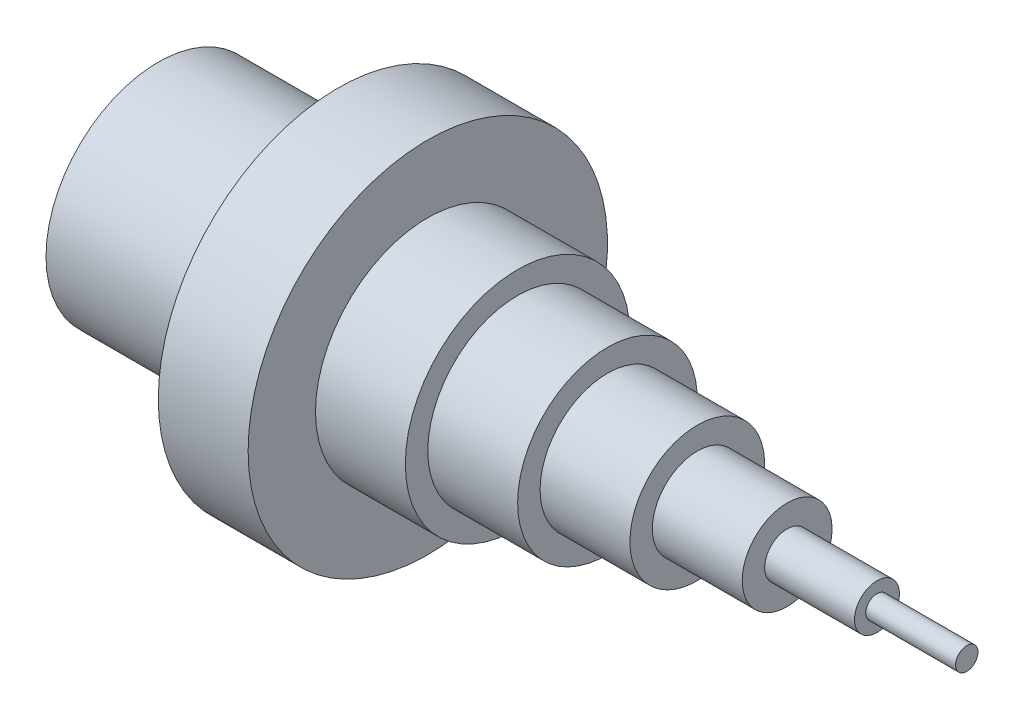
ISO-10303-21;
HEADER;
FILE_DESCRIPTION(('STEP AP214'),'2;1');
FILE_NAME('part.step','',(''),(''),'','','');
FILE_SCHEMA(('AUTOMOTIVE_DESIGN { 1 0 10303 214 1 1 1 1 }'));
ENDSEC;
DATA;
#1=APPLICATION_CONTEXT('core data for automotive mechanical design processes');
#2=APPLICATION_PROTOCOL_DEFINITION('international standard','automotive_design',2000,#1);
#3=PRODUCT_CONTEXT('',#1,'mechanical');
#4=PRODUCT('Part','Part','',(#3));
#5=PRODUCT_RELATED_PRODUCT_CATEGORY('part','',(#4));
#6=PRODUCT_DEFINITION_FORMATION('','',#4);
#7=PRODUCT_DEFINITION_CONTEXT('part definition',#1,'design');
#8=PRODUCT_DEFINITION('design','',#6,#7);
#9=PRODUCT_DEFINITION_SHAPE('','',#8);
#10=(LENGTH_UNIT() NAMED_UNIT(*) SI_UNIT(.MILLI.,.METRE.));
#11=(NAMED_UNIT(*) PLANE_ANGLE_UNIT() SI_UNIT($,.RADIAN.));
#12=(NAMED_UNIT(*) SI_UNIT($,.STERADIAN.) SOLID_ANGLE_UNIT());
#13=UNCERTAINTY_MEASURE_WITH_UNIT(LENGTH_MEASURE(1.E-05),#10,'distance_accuracy_value','');
#14=(GEOMETRIC_REPRESENTATION_CONTEXT(3) GLOBAL_UNCERTAINTY_ASSIGNED_CONTEXT((#13)) GLOBAL_UNIT_ASSIGNED_CONTEXT((#10,
#11,#12)) REPRESENTATION_CONTEXT('',''));
#15=CARTESIAN_POINT('',(0.,0.,0.));
#16=DIRECTION('',(0.,0.,1.));
#17=DIRECTION('',(1.,0.,0.));
#18=AXIS2_PLACEMENT_3D('',#15,#16,#17);
#19=CARTESIAN_POINT('',(0.,0.,0.));
#20=DIRECTION('',(-1.,0.,0.));
#21=DIRECTION('',(0.,0.,1.));
#22=AXIS2_PLACEMENT_3D('',#19,#20,#21);
#23=PLANE('',#22);
#24=CARTESIAN_POINT('',(0.,0.,0.));
#25=DIRECTION('',(-1.,0.,0.));
#26=DIRECTION('',(0.,0.,1.));
#27=AXIS2_PLACEMENT_3D('',#24,#25,#26);
#28=CIRCLE('',#27,20.);
#29=CARTESIAN_POINT('',(0.,0.,20.));
#30=VERTEX_POINT('',#29);
#31=EDGE_CURVE('E87',#30,#30,#28,.T.);
#32=ORIENTED_EDGE('',*,*,#31,.F.);
#33=EDGE_LOOP('',(#32));
#34=FACE_BOUND('',#33,.T.);
#35=CARTESIAN_POINT('',(0.,0.,0.));
#36=DIRECTION('',(-1.,0.,0.));
#37=DIRECTION('',(0.,0.,1.));
#38=AXIS2_PLACEMENT_3D('',#35,#36,#37);
#39=CIRCLE('',#38,25.);
#40=CARTESIAN_POINT('',(0.,0.,25.));
#41=VERTEX_POINT('',#40);
#42=EDGE_CURVE('E10',#41,#41,#39,.T.);
#43=ORIENTED_EDGE('',*,*,#42,.T.);
#44=EDGE_LOOP('',(#43));
#45=FACE_BOUND('',#44,.T.);
#46=ADVANCED_FACE('F31',(#34,#45),#23,.T.);
#47=CARTESIAN_POINT('',(0.,0.,0.));
#48=DIRECTION('',(-1.,0.,0.));
#49=DIRECTION('',(0.,0.,1.));
#50=AXIS2_PLACEMENT_3D('',#47,#48,#49);
#51=CYLINDRICAL_SURFACE('',#50,25.);
#52=CARTESIAN_POINT('',(40.,0.,0.));
#53=DIRECTION('',(-1.,0.,0.));
#54=DIRECTION('',(0.,0.,1.));
#55=AXIS2_PLACEMENT_3D('',#52,#53,#54);
#56=CIRCLE('',#55,25.);
#57=CARTESIAN_POINT('',(40.,0.,25.));
#58=VERTEX_POINT('',#57);
#59=EDGE_CURVE('E37',#58,#58,#56,.T.);
#60=ORIENTED_EDGE('',*,*,#59,.T.);
#61=EDGE_LOOP('',(#60));
#62=FACE_BOUND('',#61,.T.);
#63=ORIENTED_EDGE('',*,*,#42,.F.);
#64=EDGE_LOOP('',(#63));
#65=FACE_BOUND('',#64,.T.);
#66=ADVANCED_FACE('F103',(#62,#65),#51,.T.);
#67=CARTESIAN_POINT('',(40.,0.,25.));
#68=DIRECTION('',(-1.,0.,0.));
#69=DIRECTION('',(0.,0.,1.));
#70=AXIS2_PLACEMENT_3D('',#67,#68,#69);
#71=PLANE('',#70);
#72=CARTESIAN_POINT('',(40.,0.,0.));
#73=DIRECTION('',(-1.,0.,0.));
#74=DIRECTION('',(0.,0.,1.));
#75=AXIS2_PLACEMENT_3D('',#72,#73,#74);
#76=CIRCLE('',#75,40.);
#77=CARTESIAN_POINT('',(40.,0.,40.));
#78=VERTEX_POINT('',#77);
#79=EDGE_CURVE('E41',#78,#78,#76,.T.);
#80=ORIENTED_EDGE('',*,*,#79,.T.);
#81=EDGE_LOOP('',(#80));
#82=FACE_BOUND('',#81,.T.);
#83=ORIENTED_EDGE('',*,*,#59,.F.);
#84=EDGE_LOOP('',(#83));
#85=FACE_BOUND('',#84,.T.);
#86=ADVANCED_FACE('F107',(#82,#85),#71,.T.);
#87=CARTESIAN_POINT('',(0.,0.,0.));
#88=DIRECTION('',(-1.,0.,0.));
#89=DIRECTION('',(0.,0.,1.));
#90=AXIS2_PLACEMENT_3D('',#87,#88,#89);
#91=CYLINDRICAL_SURFACE('',#90,40.);
#92=CARTESIAN_POINT('',(60.,0.,0.));
#93=DIRECTION('',(-1.,0.,0.));
#94=DIRECTION('',(0.,0.,1.));
#95=AXIS2_PLACEMENT_3D('',#92,#93,#94);
#96=CIRCLE('',#95,40.);
#97=CARTESIAN_POINT('',(60.,0.,40.));
#98=VERTEX_POINT('',#97);
#99=EDGE_CURVE('E45',#98,#98,#96,.T.);
#100=ORIENTED_EDGE('',*,*,#99,.T.);
#101=EDGE_LOOP('',(#100));
#102=FACE_BOUND('',#101,.T.);
#103=ORIENTED_EDGE('',*,*,#79,.F.);
#104=EDGE_LOOP('',(#103));
#105=FACE_BOUND('',#104,.T.);
#106=ADVANCED_FACE('F111',(#102,#105),#91,.T.);
#107=CARTESIAN_POINT('',(60.,0.,40.));
#108=DIRECTION('',(1.,0.,0.));
#109=DIRECTION('',(0.,0.,-1.));
#110=AXIS2_PLACEMENT_3D('',#107,#108,#109);
#111=PLANE('',#110);
#112=CARTESIAN_POINT('',(60.,0.,0.));
#113=DIRECTION('',(-1.,0.,0.));
#114=DIRECTION('',(0.,0.,1.));
#115=AXIS2_PLACEMENT_3D('',#112,#113,#114);
#116=CIRCLE('',#115,25.);
#117=CARTESIAN_POINT('',(60.,0.,25.));
#118=VERTEX_POINT('',#117);
#119=EDGE_CURVE('E50',#118,#118,#116,.T.);
#120=ORIENTED_EDGE('',*,*,#119,.T.);
#121=EDGE_LOOP('',(#120));
#122=FACE_BOUND('',#121,.T.);
#123=ORIENTED_EDGE('',*,*,#99,.F.);
#124=EDGE_LOOP('',(#123));
#125=FACE_BOUND('',#124,.T.);
#126=ADVANCED_FACE('F118',(#122,#125),#111,.T.);
#127=CARTESIAN_POINT('',(0.,0.,0.));
#128=DIRECTION('',(-1.,0.,0.));
#129=DIRECTION('',(0.,0.,1.));
#130=AXIS2_PLACEMENT_3D('',#127,#128,#129);
#131=CYLINDRICAL_SURFACE('',#130,25.);
#132=CARTESIAN_POINT('',(80.,0.,0.));
#133=DIRECTION('',(-1.,0.,0.));
#134=DIRECTION('',(0.,0.,1.));
#135=AXIS2_PLACEMENT_3D('',#132,#133,#134);
#136=CIRCLE('',#135,25.);
#137=CARTESIAN_POINT('',(80.,0.,25.));
#138=VERTEX_POINT('',#137);
#139=EDGE_CURVE('E53',#138,#138,#136,.T.);
#140=ORIENTED_EDGE('',*,*,#139,.T.);
#141=EDGE_LOOP('',(#140));
#142=FACE_BOUND('',#141,.T.);
#143=ORIENTED_EDGE('',*,*,#119,.F.);
#144=EDGE_LOOP('',(#143));
#145=FACE_BOUND('',#144,.T.);
#146=ADVANCED_FACE('F122',(#142,#145),#131,.T.);
#147=CARTESIAN_POINT('',(80.,0.,25.));
#148=DIRECTION('',(1.,0.,0.));
#149=DIRECTION('',(0.,0.,-1.));
#150=AXIS2_PLACEMENT_3D('',#147,#148,#149);
#151=PLANE('',#150);
#152=CARTESIAN_POINT('',(80.,0.,0.));
#153=DIRECTION('',(-1.,0.,0.));
#154=DIRECTION('',(0.,0.,1.));
#155=AXIS2_PLACEMENT_3D('',#152,#153,#154);
#156=CIRCLE('',#155,20.);
#157=CARTESIAN_POINT('',(80.,0.,20.));
#158=VERTEX_POINT('',#157);
#159=EDGE_CURVE('E56',#158,#158,#156,.T.);
#160=ORIENTED_EDGE('',*,*,#159,.T.);
#161=EDGE_LOOP('',(#160));
#162=FACE_BOUND('',#161,.T.);
#163=ORIENTED_EDGE('',*,*,#139,.F.);
#164=EDGE_LOOP('',(#163));
#165=FACE_BOUND('',#164,.T.);
#166=ADVANCED_FACE('F126',(#162,#165),#151,.T.);
#167=CARTESIAN_POINT('',(0.,0.,0.));
#168=DIRECTION('',(-1.,0.,0.));
#169=DIRECTION('',(0.,0.,1.));
#170=AXIS2_PLACEMENT_3D('',#167,#168,#169);
#171=CYLINDRICAL_SURFACE('',#170,20.);
#172=CARTESIAN_POINT('',(100.,0.,0.));
#173=DIRECTION('',(-1.,0.,0.));
#174=DIRECTION('',(0.,0.,1.));
#175=AXIS2_PLACEMENT_3D('',#172,#173,#174);
#176=CIRCLE('',#175,20.);
#177=CARTESIAN_POINT('',(100.,0.,20.));
#178=VERTEX_POINT('',#177);
#179=EDGE_CURVE('E59',#178,#178,#176,.T.);
#180=ORIENTED_EDGE('',*,*,#179,.T.);
#181=EDGE_LOOP('',(#180));
#182=FACE_BOUND('',#181,.T.);
#183=ORIENTED_EDGE('',*,*,#159,.F.);
#184=EDGE_LOOP('',(#183));
#185=FACE_BOUND('',#184,.T.);
#186=ADVANCED_FACE('F130',(#182,#185),#171,.T.);
#187=CARTESIAN_POINT('',(100.,0.,20.));
#188=DIRECTION('',(1.,0.,0.));
#189=DIRECTION('',(0.,0.,-1.));
#190=AXIS2_PLACEMENT_3D('',#187,#188,#189);
#191=PLANE('',#190);
#192=CARTESIAN_POINT('',(100.,0.,0.));
#193=DIRECTION('',(-1.,0.,0.));
#194=DIRECTION('',(0.,0.,1.));
#195=AXIS2_PLACEMENT_3D('',#192,#193,#194);
#196=CIRCLE('',#195,15.);
#197=CARTESIAN_POINT('',(100.,0.,15.));
#198=VERTEX_POINT('',#197);
#199=EDGE_CURVE('E62',#198,#198,#196,.T.);
#200=ORIENTED_EDGE('',*,*,#199,.T.);
#201=EDGE_LOOP('',(#200));
#202=FACE_BOUND('',#201,.T.);
#203=ORIENTED_EDGE('',*,*,#179,.F.);
#204=EDGE_LOOP('',(#203));
#205=FACE_BOUND('',#204,.T.);
#206=ADVANCED_FACE('F134',(#202,#205),#191,.T.);
#207=CARTESIAN_POINT('',(0.,0.,0.));
#208=DIRECTION('',(-1.,0.,0.));
#209=DIRECTION('',(0.,0.,1.));
#210=AXIS2_PLACEMENT_3D('',#207,#208,#209);
#211=CYLINDRICAL_SURFACE('',#210,15.);
#212=CARTESIAN_POINT('',(120.,0.,0.));
#213=DIRECTION('',(-1.,0.,0.));
#214=DIRECTION('',(0.,0.,1.));
#215=AXIS2_PLACEMENT_3D('',#212,#213,#214);
#216=CIRCLE('',#215,15.);
#217=CARTESIAN_POINT('',(120.,0.,15.));
#218=VERTEX_POINT('',#217);
#219=EDGE_CURVE('E65',#218,#218,#216,.T.);
#220=ORIENTED_EDGE('',*,*,#219,.T.);
#221=EDGE_LOOP('',(#220));
#222=FACE_BOUND('',#221,.T.);
#223=ORIENTED_EDGE('',*,*,#199,.F.);
#224=EDGE_LOOP('',(#223));
#225=FACE_BOUND('',#224,.T.);
#226=ADVANCED_FACE('F138',(#222,#225),#211,.T.);
#227=CARTESIAN_POINT('',(120.,0.,15.));
#228=DIRECTION('',(1.,0.,0.));
#229=DIRECTION('',(0.,0.,-1.));
#230=AXIS2_PLACEMENT_3D('',#227,#228,#229);
#231=PLANE('',#230);
#232=CARTESIAN_POINT('',(120.,0.,0.));
#233=DIRECTION('',(-1.,0.,0.));
#234=DIRECTION('',(0.,0.,1.));
#235=AXIS2_PLACEMENT_3D('',#232,#233,#234);
#236=CIRCLE('',#235,10.);
#237=CARTESIAN_POINT('',(120.,0.,10.));
#238=VERTEX_POINT('',#237);
#239=EDGE_CURVE('E68',#238,#238,#236,.T.);
#240=ORIENTED_EDGE('',*,*,#239,.T.);
#241=EDGE_LOOP('',(#240));
#242=FACE_BOUND('',#241,.T.);
#243=ORIENTED_EDGE('',*,*,#219,.F.);
#244=EDGE_LOOP('',(#243));
#245=FACE_BOUND('',#244,.T.);
#246=ADVANCED_FACE('F142',(#242,#245),#231,.T.);
#247=CARTESIAN_POINT('',(0.,0.,0.));
#248=DIRECTION('',(-1.,0.,0.));
#249=DIRECTION('',(0.,0.,1.));
#250=AXIS2_PLACEMENT_3D('',#247,#248,#249);
#251=CYLINDRICAL_SURFACE('',#250,10.);
#252=CARTESIAN_POINT('',(140.,0.,0.));
#253=DIRECTION('',(-1.,0.,0.));
#254=DIRECTION('',(0.,0.,1.));
#255=AXIS2_PLACEMENT_3D('',#252,#253,#254);
#256=CIRCLE('',#255,10.);
#257=CARTESIAN_POINT('',(140.,0.,10.));
#258=VERTEX_POINT('',#257);
#259=EDGE_CURVE('E71',#258,#258,#256,.T.);
#260=ORIENTED_EDGE('',*,*,#259,.T.);
#261=EDGE_LOOP('',(#260));
#262=FACE_BOUND('',#261,.T.);
#263=ORIENTED_EDGE('',*,*,#239,.F.);
#264=EDGE_LOOP('',(#263));
#265=FACE_BOUND('',#264,.T.);
#266=ADVANCED_FACE('F146',(#262,#265),#251,.T.);
#267=CARTESIAN_POINT('',(140.,0.,10.));
#268=DIRECTION('',(1.,0.,0.));
#269=DIRECTION('',(0.,0.,-1.));
#270=AXIS2_PLACEMENT_3D('',#267,#268,#269);
#271=PLANE('',#270);
#272=CARTESIAN_POINT('',(140.,0.,0.));
#273=DIRECTION('',(-1.,0.,0.));
#274=DIRECTION('',(0.,0.,1.));
#275=AXIS2_PLACEMENT_3D('',#272,#273,#274);
#276=CIRCLE('',#275,5.);
#277=CARTESIAN_POINT('',(140.,0.,5.));
#278=VERTEX_POINT('',#277);
#279=EDGE_CURVE('E74',#278,#278,#276,.T.);
#280=ORIENTED_EDGE('',*,*,#279,.T.);
#281=EDGE_LOOP('',(#280));
#282=FACE_BOUND('',#281,.T.);
#283=ORIENTED_EDGE('',*,*,#259,.F.);
#284=EDGE_LOOP('',(#283));
#285=FACE_BOUND('',#284,.T.);
#286=ADVANCED_FACE('F150',(#282,#285),#271,.T.);
#287=CARTESIAN_POINT('',(0.,0.,0.));
#288=DIRECTION('',(-1.,0.,0.));
#289=DIRECTION('',(0.,0.,1.));
#290=AXIS2_PLACEMENT_3D('',#287,#288,#289);
#291=CYLINDRICAL_SURFACE('',#290,5.);
#292=CARTESIAN_POINT('',(160.,0.,0.));
#293=DIRECTION('',(-1.,0.,0.));
#294=DIRECTION('',(0.,0.,1.));
#295=AXIS2_PLACEMENT_3D('',#292,#293,#294);
#296=CIRCLE('',#295,5.);
#297=CARTESIAN_POINT('',(160.,0.,5.));
#298=VERTEX_POINT('',#297);
#299=EDGE_CURVE('E77',#298,#298,#296,.T.);
#300=ORIENTED_EDGE('',*,*,#299,.T.);
#301=EDGE_LOOP('',(#300));
#302=FACE_BOUND('',#301,.T.);
#303=ORIENTED_EDGE('',*,*,#279,.F.);
#304=EDGE_LOOP('',(#303));
#305=FACE_BOUND('',#304,.T.);
#306=ADVANCED_FACE('F154',(#302,#305),#291,.T.);
#307=CARTESIAN_POINT('',(160.,0.,5.));
#308=DIRECTION('',(1.,0.,0.));
#309=DIRECTION('',(0.,0.,-1.));
#310=AXIS2_PLACEMENT_3D('',#307,#308,#309);
#311=PLANE('',#310);
#312=CARTESIAN_POINT('',(160.,0.,0.));
#313=DIRECTION('',(-1.,0.,0.));
#314=DIRECTION('',(0.,0.,1.));
#315=AXIS2_PLACEMENT_3D('',#312,#313,#314);
#316=CIRCLE('',#315,2.5);
#317=CARTESIAN_POINT('',(160.,0.,2.5));
#318=VERTEX_POINT('',#317);
#319=EDGE_CURVE('E80',#318,#318,#316,.T.);
#320=ORIENTED_EDGE('',*,*,#319,.T.);
#321=EDGE_LOOP('',(#320));
#322=FACE_BOUND('',#321,.T.);
#323=ORIENTED_EDGE('',*,*,#299,.F.);
#324=EDGE_LOOP('',(#323));
#325=FACE_BOUND('',#324,.T.);
#326=ADVANCED_FACE('F158',(#322,#325),#311,.T.);
#327=CARTESIAN_POINT('',(0.,0.,0.));
#328=DIRECTION('',(-1.,0.,0.));
#329=DIRECTION('',(0.,0.,1.));
#330=AXIS2_PLACEMENT_3D('',#327,#328,#329);
#331=CYLINDRICAL_SURFACE('',#330,2.5);
#332=CARTESIAN_POINT('',(180.,0.,0.));
#333=DIRECTION('',(-1.,0.,0.));
#334=DIRECTION('',(0.,0.,1.));
#335=AXIS2_PLACEMENT_3D('',#332,#333,#334);
#336=CIRCLE('',#335,2.5);
#337=CARTESIAN_POINT('',(180.,0.,2.5));
#338=VERTEX_POINT('',#337);
#339=EDGE_CURVE('E83',#338,#338,#336,.T.);
#340=ORIENTED_EDGE('',*,*,#339,.T.);
#341=EDGE_LOOP('',(#340));
#342=FACE_BOUND('',#341,.T.);
#343=ORIENTED_EDGE('',*,*,#319,.F.);
#344=EDGE_LOOP('',(#343));
#345=FACE_BOUND('',#344,.T.);
#346=ADVANCED_FACE('F162',(#342,#345),#331,.T.);
#347=CARTESIAN_POINT('',(180.,0.,2.5));
#348=DIRECTION('',(1.,0.,0.));
#349=DIRECTION('',(0.,0.,-1.));
#350=AXIS2_PLACEMENT_3D('',#347,#348,#349);
#351=PLANE('',#350);
#352=ORIENTED_EDGE('',*,*,#339,.F.);
#353=EDGE_LOOP('',(#352));
#354=FACE_BOUND('',#353,.T.);
#355=ADVANCED_FACE('F98',(#354),#351,.T.);
#356=CARTESIAN_POINT('',(40.,0.,0.));
#357=DIRECTION('',(-1.,0.,0.));
#358=DIRECTION('',(0.,0.,1.));
#359=AXIS2_PLACEMENT_3D('',#356,#357,#358);
#360=CYLINDRICAL_SURFACE('',#359,20.);
#361=CARTESIAN_POINT('',(40.,0.,0.));
#362=DIRECTION('',(-1.,0.,0.));
#363=DIRECTION('',(0.,0.,1.));
#364=AXIS2_PLACEMENT_3D('',#361,#362,#363);
#365=CIRCLE('',#364,20.);
#366=CARTESIAN_POINT('',(40.,0.,20.));
#367=VERTEX_POINT('',#366);
#368=EDGE_CURVE('E86',#367,#367,#365,.T.);
#369=ORIENTED_EDGE('',*,*,#368,.F.);
#370=EDGE_LOOP('',(#369));
#371=FACE_BOUND('',#370,.T.);
#372=ORIENTED_EDGE('',*,*,#31,.T.);
#373=EDGE_LOOP('',(#372));
#374=FACE_BOUND('',#373,.T.);
#375=ADVANCED_FACE('F95',(#371,#374),#360,.F.);
#376=CARTESIAN_POINT('',(40.,0.,0.));
#377=DIRECTION('',(-1.,0.,0.));
#378=DIRECTION('',(0.,0.,1.));
#379=AXIS2_PLACEMENT_3D('',#376,#377,#378);
#380=PLANE('',#379);
#381=ORIENTED_EDGE('',*,*,#368,.T.);
#382=EDGE_LOOP('',(#381));
#383=FACE_BOUND('',#382,.T.);
#384=ADVANCED_FACE('F93',(#383),#380,.T.);
#385=CLOSED_SHELL('',(#46,#66,#86,#106,#126,#146,#166,#186,#206,#226,#246,#266,#286,#306,#326,
#346,#355,#375,#384));
#386=MANIFOLD_SOLID_BREP('B2',#385);
#387=ADVANCED_BREP_SHAPE_REPRESENTATION('',(#18,#386),#14);
#388=SHAPE_DEFINITION_REPRESENTATION(#9,#387);
ENDSEC;
END-ISO-10303-21;
